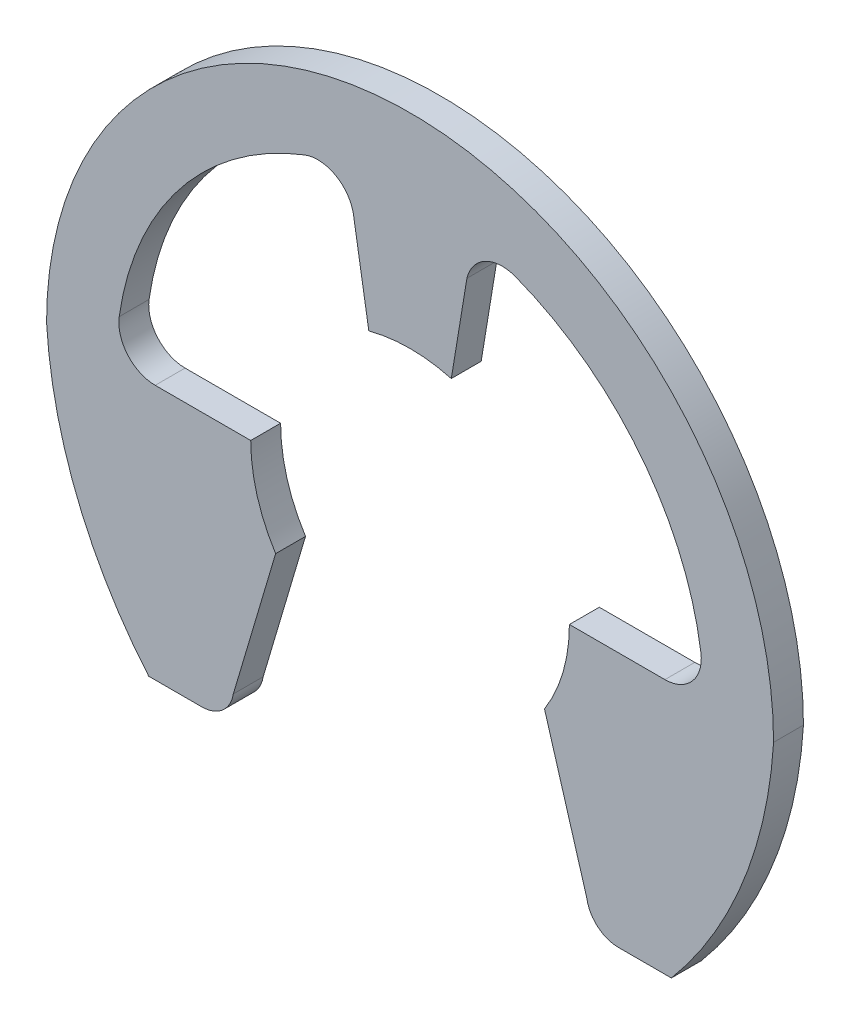
ISO-10303-21;
HEADER;
FILE_DESCRIPTION(('STEP AP214'),'2;1');
FILE_NAME('part.step','',(''),(''),'','','');
FILE_SCHEMA(('AUTOMOTIVE_DESIGN { 1 0 10303 214 1 1 1 1 }'));
ENDSEC;
DATA;
#1=APPLICATION_CONTEXT('core data for automotive mechanical design processes');
#2=APPLICATION_PROTOCOL_DEFINITION('international standard','automotive_design',2000,#1);
#3=PRODUCT_CONTEXT('',#1,'mechanical');
#4=PRODUCT('Part','Part','',(#3));
#5=PRODUCT_RELATED_PRODUCT_CATEGORY('part','',(#4));
#6=PRODUCT_DEFINITION_FORMATION('','',#4);
#7=PRODUCT_DEFINITION_CONTEXT('part definition',#1,'design');
#8=PRODUCT_DEFINITION('design','',#6,#7);
#9=PRODUCT_DEFINITION_SHAPE('','',#8);
#10=(LENGTH_UNIT() NAMED_UNIT(*) SI_UNIT(.MILLI.,.METRE.));
#11=(NAMED_UNIT(*) PLANE_ANGLE_UNIT() SI_UNIT($,.RADIAN.));
#12=(NAMED_UNIT(*) SI_UNIT($,.STERADIAN.) SOLID_ANGLE_UNIT());
#13=UNCERTAINTY_MEASURE_WITH_UNIT(LENGTH_MEASURE(1.E-05),#10,'distance_accuracy_value','');
#14=(GEOMETRIC_REPRESENTATION_CONTEXT(3) GLOBAL_UNCERTAINTY_ASSIGNED_CONTEXT((#13)) GLOBAL_UNIT_ASSIGNED_CONTEXT((#10,
#11,#12)) REPRESENTATION_CONTEXT('',''));
#15=CARTESIAN_POINT('',(0.,0.,0.));
#16=DIRECTION('',(0.,0.,1.));
#17=DIRECTION('',(1.,0.,0.));
#18=AXIS2_PLACEMENT_3D('',#15,#16,#17);
#19=CARTESIAN_POINT('',(-4.18201394390324,-4.48466089832876,0.3));
#20=DIRECTION('',(0.,0.,1.));
#21=DIRECTION('',(1.,0.,0.));
#22=AXIS2_PLACEMENT_3D('',#19,#20,#21);
#23=PLANE('',#22);
#24=CARTESIAN_POINT('',(0.,0.,0.3));
#25=DIRECTION('',(0.,0.,1.));
#26=DIRECTION('',(1.,0.,0.));
#27=AXIS2_PLACEMENT_3D('',#24,#25,#26);
#28=CIRCLE('',#27,3.2);
#29=CARTESIAN_POINT('',(-2.69962159550398,-1.71815111124969,0.3));
#30=VERTEX_POINT('',#29);
#31=CARTESIAN_POINT('',(-3.2,0.,0.3));
#32=VERTEX_POINT('',#31);
#33=EDGE_CURVE('E192',#30,#32,#28,.F.);
#34=ORIENTED_EDGE('',*,*,#33,.T.);
#35=DIRECTION('',(-1.,0.,0.));
#36=VECTOR('',#35,1.);
#37=CARTESIAN_POINT('',(-3.2,0.,0.3));
#38=LINE('',#37,#36);
#39=CARTESIAN_POINT('',(-5.11820280958072,0.,0.3));
#40=VERTEX_POINT('',#39);
#41=EDGE_CURVE('E463',#32,#40,#38,.T.);
#42=ORIENTED_EDGE('',*,*,#41,.T.);
#43=CARTESIAN_POINT('',(-5.11820280958072,0.73,0.3));
#44=DIRECTION('',(0.,0.,-1.));
#45=DIRECTION('',(-1.,0.,0.));
#46=AXIS2_PLACEMENT_3D('',#43,#44,#45);
#47=CIRCLE('',#46,0.73);
#48=CARTESIAN_POINT('',(-5.84088908636872,0.833075435203094,0.3));
#49=VERTEX_POINT('',#48);
#50=EDGE_CURVE('E476',#40,#49,#47,.T.);
#51=ORIENTED_EDGE('',*,*,#50,.T.);
#52=CARTESIAN_POINT('',(0.,0.,0.3));
#53=DIRECTION('',(0.,0.,-1.));
#54=DIRECTION('',(-1.,0.,0.));
#55=AXIS2_PLACEMENT_3D('',#52,#53,#54);
#56=CIRCLE('',#55,5.9);
#57=CARTESIAN_POINT('',(-2.11437090231727,5.50812451633349,0.3));
#58=VERTEX_POINT('',#57);
#59=EDGE_CURVE('E479',#49,#58,#56,.T.);
#60=ORIENTED_EDGE('',*,*,#59,.T.);
#61=CARTESIAN_POINT('',(-1.8527622991492,4.82661080499053,0.3));
#62=DIRECTION('',(0.,0.,-1.));
#63=DIRECTION('',(-1.,0.,0.));
#64=AXIS2_PLACEMENT_3D('',#61,#62,#63);
#65=CIRCLE('',#64,0.73);
#66=CARTESIAN_POINT('',(-1.14147215185598,4.99082507466156,0.3));
#67=VERTEX_POINT('',#66);
#68=EDGE_CURVE('E185',#58,#67,#65,.T.);
#69=ORIENTED_EDGE('',*,*,#68,.T.);
#70=DIRECTION('',(-0.162684474099473,0.986678145033616,0.));
#71=VECTOR('',#70,1.);
#72=CARTESIAN_POINT('',(-0.828220944328066,3.09096264412502,0.3));
#73=LINE('',#72,#71);
#74=CARTESIAN_POINT('',(-0.828220944328067,3.09096264412502,0.3));
#75=VERTEX_POINT('',#74);
#76=EDGE_CURVE('E168',#75,#67,#73,.T.);
#77=ORIENTED_EDGE('',*,*,#76,.F.);
#78=CARTESIAN_POINT('',(0.828220944328067,3.09096264412502,0.3));
#79=VERTEX_POINT('',#78);
#80=EDGE_CURVE('E181',#75,#79,#28,.F.);
#81=ORIENTED_EDGE('',*,*,#80,.T.);
#82=DIRECTION('',(-0.162684474099473,-0.986678145033616,0.));
#83=VECTOR('',#82,1.);
#84=CARTESIAN_POINT('',(-0.520399119135775,-5.0883915932068,0.3));
#85=LINE('',#84,#83);
#86=CARTESIAN_POINT('',(1.14147215185598,4.99082507466156,0.3));
#87=VERTEX_POINT('',#86);
#88=EDGE_CURVE('E215',#87,#79,#85,.T.);
#89=ORIENTED_EDGE('',*,*,#88,.F.);
#90=CARTESIAN_POINT('',(1.8527622991492,4.82661080499053,0.3));
#91=DIRECTION('',(0.,0.,1.));
#92=DIRECTION('',(1.,0.,0.));
#93=AXIS2_PLACEMENT_3D('',#90,#91,#92);
#94=CIRCLE('',#93,0.73);
#95=CARTESIAN_POINT('',(2.11437090231727,5.50812451633349,0.3));
#96=VERTEX_POINT('',#95);
#97=EDGE_CURVE('E226',#87,#96,#94,.F.);
#98=ORIENTED_EDGE('',*,*,#97,.T.);
#99=CARTESIAN_POINT('',(0.,0.,0.3));
#100=DIRECTION('',(0.,0.,1.));
#101=DIRECTION('',(1.,0.,0.));
#102=AXIS2_PLACEMENT_3D('',#99,#100,#101);
#103=CIRCLE('',#102,5.9);
#104=CARTESIAN_POINT('',(5.84088908636872,0.833075435203094,0.3));
#105=VERTEX_POINT('',#104);
#106=EDGE_CURVE('E230',#96,#105,#103,.F.);
#107=ORIENTED_EDGE('',*,*,#106,.T.);
#108=CARTESIAN_POINT('',(5.11820280958072,0.73,0.3));
#109=DIRECTION('',(0.,0.,1.));
#110=DIRECTION('',(1.,0.,0.));
#111=AXIS2_PLACEMENT_3D('',#108,#109,#110);
#112=CIRCLE('',#111,0.73);
#113=CARTESIAN_POINT('',(5.11820280958072,0.,0.3));
#114=VERTEX_POINT('',#113);
#115=EDGE_CURVE('E234',#105,#114,#112,.F.);
#116=ORIENTED_EDGE('',*,*,#115,.T.);
#117=DIRECTION('',(-1.,0.,0.));
#118=VECTOR('',#117,1.);
#119=CARTESIAN_POINT('',(-4.18201394390324,0.,0.3));
#120=LINE('',#119,#118);
#121=CARTESIAN_POINT('',(3.2,0.,0.3));
#122=VERTEX_POINT('',#121);
#123=EDGE_CURVE('E238',#114,#122,#120,.T.);
#124=ORIENTED_EDGE('',*,*,#123,.T.);
#125=CARTESIAN_POINT('',(2.69962159550398,-1.71815111124969,0.3));
#126=VERTEX_POINT('',#125);
#127=EDGE_CURVE('E195',#122,#126,#28,.F.);
#128=ORIENTED_EDGE('',*,*,#127,.T.);
#129=DIRECTION('',(0.284365205501345,-0.95871603194073,0.));
#130=VECTOR('',#129,1.);
#131=CARTESIAN_POINT('',(2.19,0.,0.3));
#132=LINE('',#131,#130);
#133=CARTESIAN_POINT('',(3.54989340592235,-4.5847789559545,0.3));
#134=VERTEX_POINT('',#133);
#135=EDGE_CURVE('E288',#126,#134,#132,.T.);
#136=ORIENTED_EDGE('',*,*,#135,.T.);
#137=CARTESIAN_POINT('',(4.18201394390324,-4.48466089832876,0.3));
#138=DIRECTION('',(0.,0.,1.));
#139=DIRECTION('',(1.,0.,0.));
#140=AXIS2_PLACEMENT_3D('',#137,#138,#139);
#141=CIRCLE('',#140,0.64);
#142=CARTESIAN_POINT('',(4.18201394390324,-5.12466089832876,0.3));
#143=VERTEX_POINT('',#142);
#144=EDGE_CURVE('E285',#134,#143,#141,.T.);
#145=ORIENTED_EDGE('',*,*,#144,.T.);
#146=DIRECTION('',(1.,0.,0.));
#147=VECTOR('',#146,1.);
#148=CARTESIAN_POINT('',(4.18201394390324,-5.12466089832876,0.3));
#149=LINE('',#148,#147);
#150=CARTESIAN_POINT('',(5.24781394390324,-5.12466089832876,0.3));
#151=VERTEX_POINT('',#150);
#152=EDGE_CURVE('E282',#143,#151,#149,.T.);
#153=ORIENTED_EDGE('',*,*,#152,.T.);
#154=CARTESIAN_POINT('',(-1.44405206702632,0.528349741300863,0.3));
#155=DIRECTION('',(0.,0.,1.));
#156=DIRECTION('',(1.,0.,0.));
#157=AXIS2_PLACEMENT_3D('',#154,#155,#156);
#158=CIRCLE('',#157,8.76);
#159=CARTESIAN_POINT('',(7.3,0.,0.3));
#160=VERTEX_POINT('',#159);
#161=EDGE_CURVE('E279',#151,#160,#158,.T.);
#162=ORIENTED_EDGE('',*,*,#161,.T.);
#163=CARTESIAN_POINT('',(0.,0.,0.3));
#164=DIRECTION('',(0.,0.,1.));
#165=DIRECTION('',(1.,0.,0.));
#166=AXIS2_PLACEMENT_3D('',#163,#164,#165);
#167=CIRCLE('',#166,7.3);
#168=CARTESIAN_POINT('',(-7.3,0.,0.3));
#169=VERTEX_POINT('',#168);
#170=EDGE_CURVE('E276',#160,#169,#167,.T.);
#171=ORIENTED_EDGE('',*,*,#170,.T.);
#172=CARTESIAN_POINT('',(1.44405206702632,0.528349741300862,0.3));
#173=DIRECTION('',(0.,0.,1.));
#174=DIRECTION('',(1.,0.,0.));
#175=AXIS2_PLACEMENT_3D('',#172,#173,#174);
#176=CIRCLE('',#175,8.76);
#177=CARTESIAN_POINT('',(-5.24781394390324,-5.12466089832875,0.3));
#178=VERTEX_POINT('',#177);
#179=EDGE_CURVE('E273',#169,#178,#176,.T.);
#180=ORIENTED_EDGE('',*,*,#179,.T.);
#181=DIRECTION('',(1.,0.,0.));
#182=VECTOR('',#181,1.);
#183=CARTESIAN_POINT('',(-5.24781394390324,-5.12466089832875,0.3));
#184=LINE('',#183,#182);
#185=CARTESIAN_POINT('',(-4.18201394390324,-5.12466089832875,0.3));
#186=VERTEX_POINT('',#185);
#187=EDGE_CURVE('E269',#178,#186,#184,.T.);
#188=ORIENTED_EDGE('',*,*,#187,.T.);
#189=CARTESIAN_POINT('',(-4.18201394390324,-4.48466089832876,0.3));
#190=DIRECTION('',(0.,0.,1.));
#191=DIRECTION('',(1.,0.,0.));
#192=AXIS2_PLACEMENT_3D('',#189,#190,#191);
#193=CIRCLE('',#192,0.64);
#194=CARTESIAN_POINT('',(-3.54989340592235,-4.5847789559545,0.3));
#195=VERTEX_POINT('',#194);
#196=EDGE_CURVE('E244',#186,#195,#193,.T.);
#197=ORIENTED_EDGE('',*,*,#196,.T.);
#198=DIRECTION('',(0.284365205501345,0.95871603194073,0.));
#199=VECTOR('',#198,1.);
#200=CARTESIAN_POINT('',(-3.54989340592235,-4.5847789559545,0.3));
#201=LINE('',#200,#199);
#202=EDGE_CURVE('E290',#195,#30,#201,.T.);
#203=ORIENTED_EDGE('',*,*,#202,.T.);
#204=EDGE_LOOP('',(#34,#42,#51,#60,#69,#77,#81,#89,#98,#107,#116,#124,#128,#136,#145,#153,#162,
#171,#180,#188,#197,#203));
#205=FACE_BOUND('',#204,.T.);
#206=ADVANCED_FACE('F16',(#205),#23,.T.);
#207=CARTESIAN_POINT('',(-4.18201394390324,-4.48466089832876,-0.3));
#208=DIRECTION('',(0.,0.,1.));
#209=DIRECTION('',(1.,0.,0.));
#210=AXIS2_PLACEMENT_3D('',#207,#208,#209);
#211=PLANE('',#210);
#212=DIRECTION('',(-1.,0.,0.));
#213=VECTOR('',#212,1.);
#214=CARTESIAN_POINT('',(-4.18201394390324,0.,-0.3));
#215=LINE('',#214,#213);
#216=CARTESIAN_POINT('',(-3.2,0.,-0.3));
#217=VERTEX_POINT('',#216);
#218=CARTESIAN_POINT('',(-5.11820280958072,0.,-0.3));
#219=VERTEX_POINT('',#218);
#220=EDGE_CURVE('E353',#217,#219,#215,.T.);
#221=ORIENTED_EDGE('',*,*,#220,.F.);
#222=CARTESIAN_POINT('',(0.,0.,-0.3));
#223=DIRECTION('',(0.,0.,1.));
#224=DIRECTION('',(1.,0.,0.));
#225=AXIS2_PLACEMENT_3D('',#222,#223,#224);
#226=CIRCLE('',#225,3.2);
#227=CARTESIAN_POINT('',(-2.69962159550398,-1.71815111124969,-0.3));
#228=VERTEX_POINT('',#227);
#229=EDGE_CURVE('E40',#217,#228,#226,.T.);
#230=ORIENTED_EDGE('',*,*,#229,.T.);
#231=DIRECTION('',(0.284365205501345,0.95871603194073,0.));
#232=VECTOR('',#231,1.);
#233=CARTESIAN_POINT('',(-3.54989340592235,-4.5847789559545,-0.3));
#234=LINE('',#233,#232);
#235=CARTESIAN_POINT('',(-3.54989340592235,-4.5847789559545,-0.3));
#236=VERTEX_POINT('',#235);
#237=EDGE_CURVE('E263',#236,#228,#234,.T.);
#238=ORIENTED_EDGE('',*,*,#237,.F.);
#239=CARTESIAN_POINT('',(-4.18201394390324,-4.48466089832876,-0.3));
#240=DIRECTION('',(0.,0.,1.));
#241=DIRECTION('',(1.,0.,0.));
#242=AXIS2_PLACEMENT_3D('',#239,#240,#241);
#243=CIRCLE('',#242,0.64);
#244=CARTESIAN_POINT('',(-4.18201394390324,-5.12466089832875,-0.3));
#245=VERTEX_POINT('',#244);
#246=EDGE_CURVE('E240',#245,#236,#243,.T.);
#247=ORIENTED_EDGE('',*,*,#246,.F.);
#248=DIRECTION('',(1.,0.,0.));
#249=VECTOR('',#248,1.);
#250=CARTESIAN_POINT('',(-5.24781394390324,-5.12466089832875,-0.3));
#251=LINE('',#250,#249);
#252=CARTESIAN_POINT('',(-5.24781394390324,-5.12466089832875,-0.3));
#253=VERTEX_POINT('',#252);
#254=EDGE_CURVE('E241',#253,#245,#251,.T.);
#255=ORIENTED_EDGE('',*,*,#254,.F.);
#256=CARTESIAN_POINT('',(1.44405206702632,0.528349741300862,-0.3));
#257=DIRECTION('',(0.,0.,1.));
#258=DIRECTION('',(1.,0.,0.));
#259=AXIS2_PLACEMENT_3D('',#256,#257,#258);
#260=CIRCLE('',#259,8.76);
#261=CARTESIAN_POINT('',(-7.3,0.,-0.3));
#262=VERTEX_POINT('',#261);
#263=EDGE_CURVE('E245',#262,#253,#260,.T.);
#264=ORIENTED_EDGE('',*,*,#263,.F.);
#265=CARTESIAN_POINT('',(0.,0.,-0.3));
#266=DIRECTION('',(0.,0.,1.));
#267=DIRECTION('',(1.,0.,0.));
#268=AXIS2_PLACEMENT_3D('',#265,#266,#267);
#269=CIRCLE('',#268,7.3);
#270=CARTESIAN_POINT('',(7.3,0.,-0.3));
#271=VERTEX_POINT('',#270);
#272=EDGE_CURVE('E248',#271,#262,#269,.T.);
#273=ORIENTED_EDGE('',*,*,#272,.F.);
#274=CARTESIAN_POINT('',(-1.44405206702632,0.528349741300863,-0.3));
#275=DIRECTION('',(0.,0.,1.));
#276=DIRECTION('',(1.,0.,0.));
#277=AXIS2_PLACEMENT_3D('',#274,#275,#276);
#278=CIRCLE('',#277,8.76);
#279=CARTESIAN_POINT('',(5.24781394390324,-5.12466089832876,-0.3));
#280=VERTEX_POINT('',#279);
#281=EDGE_CURVE('E251',#280,#271,#278,.T.);
#282=ORIENTED_EDGE('',*,*,#281,.F.);
#283=DIRECTION('',(1.,0.,0.));
#284=VECTOR('',#283,1.);
#285=CARTESIAN_POINT('',(4.18201394390324,-5.12466089832876,-0.3));
#286=LINE('',#285,#284);
#287=CARTESIAN_POINT('',(4.18201394390324,-5.12466089832876,-0.3));
#288=VERTEX_POINT('',#287);
#289=EDGE_CURVE('E254',#288,#280,#286,.T.);
#290=ORIENTED_EDGE('',*,*,#289,.F.);
#291=CARTESIAN_POINT('',(4.18201394390324,-4.48466089832876,-0.3));
#292=DIRECTION('',(0.,0.,1.));
#293=DIRECTION('',(1.,0.,0.));
#294=AXIS2_PLACEMENT_3D('',#291,#292,#293);
#295=CIRCLE('',#294,0.64);
#296=CARTESIAN_POINT('',(3.54989340592235,-4.5847789559545,-0.3));
#297=VERTEX_POINT('',#296);
#298=EDGE_CURVE('E257',#297,#288,#295,.T.);
#299=ORIENTED_EDGE('',*,*,#298,.F.);
#300=DIRECTION('',(0.284365205501345,-0.95871603194073,0.));
#301=VECTOR('',#300,1.);
#302=CARTESIAN_POINT('',(2.19,0.,-0.3));
#303=LINE('',#302,#301);
#304=CARTESIAN_POINT('',(2.69962159550398,-1.71815111124969,-0.3));
#305=VERTEX_POINT('',#304);
#306=EDGE_CURVE('E260',#305,#297,#303,.T.);
#307=ORIENTED_EDGE('',*,*,#306,.F.);
#308=CARTESIAN_POINT('',(0.,0.,-0.3));
#309=DIRECTION('',(0.,0.,1.));
#310=DIRECTION('',(1.,0.,0.));
#311=AXIS2_PLACEMENT_3D('',#308,#309,#310);
#312=CIRCLE('',#311,3.2);
#313=CARTESIAN_POINT('',(3.2,0.,-0.3));
#314=VERTEX_POINT('',#313);
#315=EDGE_CURVE('E301',#314,#305,#312,.F.);
#316=ORIENTED_EDGE('',*,*,#315,.F.);
#317=DIRECTION('',(1.,0.,0.));
#318=VECTOR('',#317,1.);
#319=CARTESIAN_POINT('',(3.2,0.,-0.3));
#320=LINE('',#319,#318);
#321=CARTESIAN_POINT('',(5.11820280958072,0.,-0.3));
#322=VERTEX_POINT('',#321);
#323=EDGE_CURVE('E359',#314,#322,#320,.T.);
#324=ORIENTED_EDGE('',*,*,#323,.T.);
#325=CARTESIAN_POINT('',(5.11820280958072,0.73,-0.3));
#326=DIRECTION('',(0.,0.,1.));
#327=DIRECTION('',(1.,0.,0.));
#328=AXIS2_PLACEMENT_3D('',#325,#326,#327);
#329=CIRCLE('',#328,0.73);
#330=CARTESIAN_POINT('',(5.84088908636872,0.833075435203094,-0.3));
#331=VERTEX_POINT('',#330);
#332=EDGE_CURVE('E379',#322,#331,#329,.T.);
#333=ORIENTED_EDGE('',*,*,#332,.T.);
#334=CARTESIAN_POINT('',(0.,0.,-0.3));
#335=DIRECTION('',(0.,0.,1.));
#336=DIRECTION('',(1.,0.,0.));
#337=AXIS2_PLACEMENT_3D('',#334,#335,#336);
#338=CIRCLE('',#337,5.9);
#339=CARTESIAN_POINT('',(2.11437090231727,5.50812451633349,-0.3));
#340=VERTEX_POINT('',#339);
#341=EDGE_CURVE('E375',#331,#340,#338,.T.);
#342=ORIENTED_EDGE('',*,*,#341,.T.);
#343=CARTESIAN_POINT('',(1.8527622991492,4.82661080499053,-0.3));
#344=DIRECTION('',(0.,0.,1.));
#345=DIRECTION('',(1.,0.,0.));
#346=AXIS2_PLACEMENT_3D('',#343,#344,#345);
#347=CIRCLE('',#346,0.73);
#348=CARTESIAN_POINT('',(1.14147215185598,4.99082507466156,-0.3));
#349=VERTEX_POINT('',#348);
#350=EDGE_CURVE('E371',#340,#349,#347,.T.);
#351=ORIENTED_EDGE('',*,*,#350,.T.);
#352=DIRECTION('',(0.162684474099473,0.986678145033616,0.));
#353=VECTOR('',#352,1.);
#354=CARTESIAN_POINT('',(0.828220944328066,3.09096264412502,-0.3));
#355=LINE('',#354,#353);
#356=CARTESIAN_POINT('',(0.828220944328067,3.09096264412502,-0.3));
#357=VERTEX_POINT('',#356);
#358=EDGE_CURVE('E367',#357,#349,#355,.T.);
#359=ORIENTED_EDGE('',*,*,#358,.F.);
#360=CARTESIAN_POINT('',(-0.828220944328067,3.09096264412502,-0.3));
#361=VERTEX_POINT('',#360);
#362=EDGE_CURVE('E351',#357,#361,#226,.T.);
#363=ORIENTED_EDGE('',*,*,#362,.T.);
#364=DIRECTION('',(-0.162684474099473,0.986678145033616,0.));
#365=VECTOR('',#364,1.);
#366=CARTESIAN_POINT('',(0.299034765473132,-3.74582112938446,-0.3));
#367=LINE('',#366,#365);
#368=CARTESIAN_POINT('',(-1.14147215185598,4.99082507466156,-0.3));
#369=VERTEX_POINT('',#368);
#370=EDGE_CURVE('E32',#361,#369,#367,.T.);
#371=ORIENTED_EDGE('',*,*,#370,.T.);
#372=CARTESIAN_POINT('',(-1.8527622991492,4.82661080499053,-0.3));
#373=DIRECTION('',(0.,0.,1.));
#374=DIRECTION('',(1.,0.,0.));
#375=AXIS2_PLACEMENT_3D('',#372,#373,#374);
#376=CIRCLE('',#375,0.73);
#377=CARTESIAN_POINT('',(-2.11437090231727,5.50812451633349,-0.3));
#378=VERTEX_POINT('',#377);
#379=EDGE_CURVE('E331',#378,#369,#376,.F.);
#380=ORIENTED_EDGE('',*,*,#379,.F.);
#381=CARTESIAN_POINT('',(0.,0.,-0.3));
#382=DIRECTION('',(0.,0.,1.));
#383=DIRECTION('',(1.,0.,0.));
#384=AXIS2_PLACEMENT_3D('',#381,#382,#383);
#385=CIRCLE('',#384,5.9);
#386=CARTESIAN_POINT('',(-5.84088908636872,0.833075435203094,-0.3));
#387=VERTEX_POINT('',#386);
#388=EDGE_CURVE('E25',#387,#378,#385,.F.);
#389=ORIENTED_EDGE('',*,*,#388,.F.);
#390=CARTESIAN_POINT('',(-5.11820280958072,0.73,-0.3));
#391=DIRECTION('',(0.,0.,1.));
#392=DIRECTION('',(1.,0.,0.));
#393=AXIS2_PLACEMENT_3D('',#390,#391,#392);
#394=CIRCLE('',#393,0.73);
#395=EDGE_CURVE('E11',#219,#387,#394,.F.);
#396=ORIENTED_EDGE('',*,*,#395,.F.);
#397=EDGE_LOOP('',(#221,#230,#238,#247,#255,#264,#273,#282,#290,#299,#307,#316,#324,#333,#342,
#351,#359,#363,#371,#380,#389,#396));
#398=FACE_BOUND('',#397,.T.);
#399=ADVANCED_FACE('F349',(#398),#211,.F.);
#400=CARTESIAN_POINT('',(0.,0.,1.3));
#401=DIRECTION('',(0.,0.,-1.));
#402=DIRECTION('',(-1.,0.,0.));
#403=AXIS2_PLACEMENT_3D('',#400,#401,#402);
#404=CYLINDRICAL_SURFACE('',#403,3.2);
#405=ORIENTED_EDGE('',*,*,#229,.F.);
#406=DIRECTION('',(0.,0.,1.));
#407=VECTOR('',#406,1.);
#408=CARTESIAN_POINT('',(-3.2,0.,-1.3));
#409=LINE('',#408,#407);
#410=EDGE_CURVE('E176',#217,#32,#409,.T.);
#411=ORIENTED_EDGE('',*,*,#410,.T.);
#412=ORIENTED_EDGE('',*,*,#33,.F.);
#413=DIRECTION('',(0.,0.,-1.));
#414=VECTOR('',#413,1.);
#415=CARTESIAN_POINT('',(-2.69962159550398,-1.71815111124969,1.3));
#416=LINE('',#415,#414);
#417=EDGE_CURVE('E200',#30,#228,#416,.T.);
#418=ORIENTED_EDGE('',*,*,#417,.T.);
#419=EDGE_LOOP('',(#405,#411,#412,#418));
#420=FACE_BOUND('',#419,.T.);
#421=ADVANCED_FACE('F465',(#420),#404,.F.);
#422=CARTESIAN_POINT('',(-3.54989340592235,-4.5847789559545,0.3));
#423=DIRECTION('',(-0.95871603194073,0.284365205501345,0.));
#424=DIRECTION('',(-0.284365205501345,-0.95871603194073,0.));
#425=AXIS2_PLACEMENT_3D('',#422,#423,#424);
#426=PLANE('',#425);
#427=ORIENTED_EDGE('',*,*,#417,.F.);
#428=ORIENTED_EDGE('',*,*,#202,.F.);
#429=DIRECTION('',(0.,0.,-1.));
#430=VECTOR('',#429,1.);
#431=CARTESIAN_POINT('',(-3.54989340592235,-4.5847789559545,0.3));
#432=LINE('',#431,#430);
#433=EDGE_CURVE('E297',#195,#236,#432,.T.);
#434=ORIENTED_EDGE('',*,*,#433,.T.);
#435=ORIENTED_EDGE('',*,*,#237,.T.);
#436=EDGE_LOOP('',(#427,#428,#434,#435));
#437=FACE_BOUND('',#436,.T.);
#438=ADVANCED_FACE('F460',(#437),#426,.F.);
#439=CARTESIAN_POINT('',(2.19,0.,0.3));
#440=DIRECTION('',(0.95871603194073,0.284365205501345,0.));
#441=DIRECTION('',(-0.284365205501345,0.95871603194073,0.));
#442=AXIS2_PLACEMENT_3D('',#439,#440,#441);
#443=PLANE('',#442);
#444=DIRECTION('',(0.,0.,-1.));
#445=VECTOR('',#444,1.);
#446=CARTESIAN_POINT('',(2.69962159550398,-1.71815111124969,1.3));
#447=LINE('',#446,#445);
#448=EDGE_CURVE('E208',#305,#126,#447,.F.);
#449=ORIENTED_EDGE('',*,*,#448,.F.);
#450=ORIENTED_EDGE('',*,*,#306,.T.);
#451=DIRECTION('',(0.,0.,-1.));
#452=VECTOR('',#451,1.);
#453=CARTESIAN_POINT('',(3.54989340592235,-4.5847789559545,0.3));
#454=LINE('',#453,#452);
#455=EDGE_CURVE('E302',#134,#297,#454,.T.);
#456=ORIENTED_EDGE('',*,*,#455,.F.);
#457=ORIENTED_EDGE('',*,*,#135,.F.);
#458=EDGE_LOOP('',(#449,#450,#456,#457));
#459=FACE_BOUND('',#458,.T.);
#460=ADVANCED_FACE('F423',(#459),#443,.F.);
#461=CARTESIAN_POINT('',(-4.18201394390324,-4.48466089832876,0.3));
#462=DIRECTION('',(0.,0.,-1.));
#463=DIRECTION('',(-1.,0.,0.));
#464=AXIS2_PLACEMENT_3D('',#461,#462,#463);
#465=CYLINDRICAL_SURFACE('',#464,0.64);
#466=ORIENTED_EDGE('',*,*,#246,.T.);
#467=ORIENTED_EDGE('',*,*,#433,.F.);
#468=ORIENTED_EDGE('',*,*,#196,.F.);
#469=DIRECTION('',(0.,0.,-1.));
#470=VECTOR('',#469,1.);
#471=CARTESIAN_POINT('',(-4.18201394390324,-5.12466089832875,0.3));
#472=LINE('',#471,#470);
#473=EDGE_CURVE('E272',#186,#245,#472,.T.);
#474=ORIENTED_EDGE('',*,*,#473,.T.);
#475=EDGE_LOOP('',(#466,#467,#468,#474));
#476=FACE_BOUND('',#475,.T.);
#477=ADVANCED_FACE('F18',(#476),#465,.T.);
#478=CARTESIAN_POINT('',(4.18201394390324,-4.48466089832876,0.3));
#479=DIRECTION('',(0.,0.,-1.));
#480=DIRECTION('',(-1.,0.,0.));
#481=AXIS2_PLACEMENT_3D('',#478,#479,#480);
#482=CYLINDRICAL_SURFACE('',#481,0.64);
#483=ORIENTED_EDGE('',*,*,#298,.T.);
#484=DIRECTION('',(0.,0.,-1.));
#485=VECTOR('',#484,1.);
#486=CARTESIAN_POINT('',(4.18201394390324,-5.12466089832876,0.3));
#487=LINE('',#486,#485);
#488=EDGE_CURVE('E306',#143,#288,#487,.T.);
#489=ORIENTED_EDGE('',*,*,#488,.F.);
#490=ORIENTED_EDGE('',*,*,#144,.F.);
#491=ORIENTED_EDGE('',*,*,#455,.T.);
#492=EDGE_LOOP('',(#483,#489,#490,#491));
#493=FACE_BOUND('',#492,.T.);
#494=ADVANCED_FACE('F430',(#493),#482,.T.);
#495=CARTESIAN_POINT('',(4.18201394390324,-5.12466089832876,0.3));
#496=DIRECTION('',(0.,1.,0.));
#497=DIRECTION('',(0.,0.,1.));
#498=AXIS2_PLACEMENT_3D('',#495,#496,#497);
#499=PLANE('',#498);
#500=ORIENTED_EDGE('',*,*,#289,.T.);
#501=DIRECTION('',(0.,0.,-1.));
#502=VECTOR('',#501,1.);
#503=CARTESIAN_POINT('',(5.24781394390324,-5.12466089832876,0.3));
#504=LINE('',#503,#502);
#505=EDGE_CURVE('E310',#151,#280,#504,.T.);
#506=ORIENTED_EDGE('',*,*,#505,.F.);
#507=ORIENTED_EDGE('',*,*,#152,.F.);
#508=ORIENTED_EDGE('',*,*,#488,.T.);
#509=EDGE_LOOP('',(#500,#506,#507,#508));
#510=FACE_BOUND('',#509,.T.);
#511=ADVANCED_FACE('F434',(#510),#499,.F.);
#512=CARTESIAN_POINT('',(-1.44405206702632,0.528349741300863,0.3));
#513=DIRECTION('',(0.,0.,-1.));
#514=DIRECTION('',(-1.,0.,0.));
#515=AXIS2_PLACEMENT_3D('',#512,#513,#514);
#516=CYLINDRICAL_SURFACE('',#515,8.76);
#517=ORIENTED_EDGE('',*,*,#281,.T.);
#518=DIRECTION('',(0.,0.,-1.));
#519=VECTOR('',#518,1.);
#520=CARTESIAN_POINT('',(7.3,0.,0.3));
#521=LINE('',#520,#519);
#522=EDGE_CURVE('E314',#160,#271,#521,.T.);
#523=ORIENTED_EDGE('',*,*,#522,.F.);
#524=ORIENTED_EDGE('',*,*,#161,.F.);
#525=ORIENTED_EDGE('',*,*,#505,.T.);
#526=EDGE_LOOP('',(#517,#523,#524,#525));
#527=FACE_BOUND('',#526,.T.);
#528=ADVANCED_FACE('F441',(#527),#516,.T.);
#529=CARTESIAN_POINT('',(0.,0.,0.3));
#530=DIRECTION('',(0.,0.,-1.));
#531=DIRECTION('',(-1.,0.,0.));
#532=AXIS2_PLACEMENT_3D('',#529,#530,#531);
#533=CYLINDRICAL_SURFACE('',#532,7.3);
#534=ORIENTED_EDGE('',*,*,#272,.T.);
#535=DIRECTION('',(0.,0.,-1.));
#536=VECTOR('',#535,1.);
#537=CARTESIAN_POINT('',(-7.3,0.,0.3));
#538=LINE('',#537,#536);
#539=EDGE_CURVE('E318',#169,#262,#538,.T.);
#540=ORIENTED_EDGE('',*,*,#539,.F.);
#541=ORIENTED_EDGE('',*,*,#170,.F.);
#542=ORIENTED_EDGE('',*,*,#522,.T.);
#543=EDGE_LOOP('',(#534,#540,#541,#542));
#544=FACE_BOUND('',#543,.T.);
#545=ADVANCED_FACE('F444',(#544),#533,.T.);
#546=CARTESIAN_POINT('',(1.44405206702632,0.528349741300862,0.3));
#547=DIRECTION('',(0.,0.,-1.));
#548=DIRECTION('',(-1.,0.,0.));
#549=AXIS2_PLACEMENT_3D('',#546,#547,#548);
#550=CYLINDRICAL_SURFACE('',#549,8.76);
#551=ORIENTED_EDGE('',*,*,#263,.T.);
#552=DIRECTION('',(0.,0.,-1.));
#553=VECTOR('',#552,1.);
#554=CARTESIAN_POINT('',(-5.24781394390324,-5.12466089832875,0.3));
#555=LINE('',#554,#553);
#556=EDGE_CURVE('E322',#178,#253,#555,.T.);
#557=ORIENTED_EDGE('',*,*,#556,.F.);
#558=ORIENTED_EDGE('',*,*,#179,.F.);
#559=ORIENTED_EDGE('',*,*,#539,.T.);
#560=EDGE_LOOP('',(#551,#557,#558,#559));
#561=FACE_BOUND('',#560,.T.);
#562=ADVANCED_FACE('F449',(#561),#550,.T.);
#563=CARTESIAN_POINT('',(-5.24781394390324,-5.12466089832875,0.3));
#564=DIRECTION('',(0.,1.,0.));
#565=DIRECTION('',(0.,0.,1.));
#566=AXIS2_PLACEMENT_3D('',#563,#564,#565);
#567=PLANE('',#566);
#568=ORIENTED_EDGE('',*,*,#254,.T.);
#569=ORIENTED_EDGE('',*,*,#473,.F.);
#570=ORIENTED_EDGE('',*,*,#187,.F.);
#571=ORIENTED_EDGE('',*,*,#556,.T.);
#572=EDGE_LOOP('',(#568,#569,#570,#571));
#573=FACE_BOUND('',#572,.T.);
#574=ADVANCED_FACE('F455',(#573),#567,.F.);
#575=ORIENTED_EDGE('',*,*,#448,.T.);
#576=ORIENTED_EDGE('',*,*,#127,.F.);
#577=DIRECTION('',(0.,0.,-1.));
#578=VECTOR('',#577,1.);
#579=CARTESIAN_POINT('',(3.2,0.,1.3));
#580=LINE('',#579,#578);
#581=EDGE_CURVE('E366',#122,#314,#580,.T.);
#582=ORIENTED_EDGE('',*,*,#581,.T.);
#583=ORIENTED_EDGE('',*,*,#315,.T.);
#584=EDGE_LOOP('',(#575,#576,#582,#583));
#585=FACE_BOUND('',#584,.T.);
#586=ADVANCED_FACE('F419',(#585),#404,.F.);
#587=DIRECTION('',(0.,0.,1.));
#588=VECTOR('',#587,1.);
#589=CARTESIAN_POINT('',(-0.828220944328066,3.09096264412502,-1.3));
#590=LINE('',#589,#588);
#591=EDGE_CURVE('E165',#361,#75,#590,.T.);
#592=ORIENTED_EDGE('',*,*,#591,.F.);
#593=ORIENTED_EDGE('',*,*,#362,.F.);
#594=DIRECTION('',(0.,0.,-1.));
#595=VECTOR('',#594,1.);
#596=CARTESIAN_POINT('',(0.828220944328067,3.09096264412502,1.3));
#597=LINE('',#596,#595);
#598=EDGE_CURVE('E190',#79,#357,#597,.T.);
#599=ORIENTED_EDGE('',*,*,#598,.F.);
#600=ORIENTED_EDGE('',*,*,#80,.F.);
#601=EDGE_LOOP('',(#592,#593,#599,#600));
#602=FACE_BOUND('',#601,.T.);
#603=ADVANCED_FACE('F189',(#602),#404,.F.);
#604=CARTESIAN_POINT('',(3.2,0.,1.3));
#605=DIRECTION('',(0.,1.,0.));
#606=DIRECTION('',(0.,0.,1.));
#607=AXIS2_PLACEMENT_3D('',#604,#605,#606);
#608=PLANE('',#607);
#609=DIRECTION('',(0.,0.,-1.));
#610=VECTOR('',#609,1.);
#611=CARTESIAN_POINT('',(5.11820280958072,0.,1.3));
#612=LINE('',#611,#610);
#613=EDGE_CURVE('E193',#114,#322,#612,.T.);
#614=ORIENTED_EDGE('',*,*,#613,.T.);
#615=ORIENTED_EDGE('',*,*,#323,.F.);
#616=ORIENTED_EDGE('',*,*,#581,.F.);
#617=ORIENTED_EDGE('',*,*,#123,.F.);
#618=EDGE_LOOP('',(#614,#615,#616,#617));
#619=FACE_BOUND('',#618,.T.);
#620=ADVANCED_FACE('F415',(#619),#608,.T.);
#621=CARTESIAN_POINT('',(5.11820280958072,0.73,1.3));
#622=DIRECTION('',(0.,0.,-1.));
#623=DIRECTION('',(-1.,0.,0.));
#624=AXIS2_PLACEMENT_3D('',#621,#622,#623);
#625=CYLINDRICAL_SURFACE('',#624,0.73);
#626=DIRECTION('',(0.,0.,-1.));
#627=VECTOR('',#626,1.);
#628=CARTESIAN_POINT('',(5.84088908636872,0.833075435203094,1.3));
#629=LINE('',#628,#627);
#630=EDGE_CURVE('E202',#105,#331,#629,.T.);
#631=ORIENTED_EDGE('',*,*,#630,.T.);
#632=ORIENTED_EDGE('',*,*,#332,.F.);
#633=ORIENTED_EDGE('',*,*,#613,.F.);
#634=ORIENTED_EDGE('',*,*,#115,.F.);
#635=EDGE_LOOP('',(#631,#632,#633,#634));
#636=FACE_BOUND('',#635,.T.);
#637=ADVANCED_FACE('F411',(#636),#625,.F.);
#638=CARTESIAN_POINT('',(0.,0.,1.3));
#639=DIRECTION('',(0.,0.,-1.));
#640=DIRECTION('',(-1.,0.,0.));
#641=AXIS2_PLACEMENT_3D('',#638,#639,#640);
#642=CYLINDRICAL_SURFACE('',#641,5.9);
#643=DIRECTION('',(0.,0.,-1.));
#644=VECTOR('',#643,1.);
#645=CARTESIAN_POINT('',(2.11437090231727,5.50812451633349,1.3));
#646=LINE('',#645,#644);
#647=EDGE_CURVE('E388',#96,#340,#646,.T.);
#648=ORIENTED_EDGE('',*,*,#647,.T.);
#649=ORIENTED_EDGE('',*,*,#341,.F.);
#650=ORIENTED_EDGE('',*,*,#630,.F.);
#651=ORIENTED_EDGE('',*,*,#106,.F.);
#652=EDGE_LOOP('',(#648,#649,#650,#651));
#653=FACE_BOUND('',#652,.T.);
#654=ADVANCED_FACE('F408',(#653),#642,.F.);
#655=CARTESIAN_POINT('',(1.8527622991492,4.82661080499053,1.3));
#656=DIRECTION('',(0.,0.,-1.));
#657=DIRECTION('',(-1.,0.,0.));
#658=AXIS2_PLACEMENT_3D('',#655,#656,#657);
#659=CYLINDRICAL_SURFACE('',#658,0.73);
#660=DIRECTION('',(0.,0.,-1.));
#661=VECTOR('',#660,1.);
#662=CARTESIAN_POINT('',(1.14147215185598,4.99082507466156,1.3));
#663=LINE('',#662,#661);
#664=EDGE_CURVE('E391',#87,#349,#663,.T.);
#665=ORIENTED_EDGE('',*,*,#664,.T.);
#666=ORIENTED_EDGE('',*,*,#350,.F.);
#667=ORIENTED_EDGE('',*,*,#647,.F.);
#668=ORIENTED_EDGE('',*,*,#97,.F.);
#669=EDGE_LOOP('',(#665,#666,#667,#668));
#670=FACE_BOUND('',#669,.T.);
#671=ADVANCED_FACE('F405',(#670),#659,.F.);
#672=CARTESIAN_POINT('',(0.828220944328066,3.09096264412502,1.3));
#673=DIRECTION('',(-0.986678145033616,0.162684474099473,0.));
#674=DIRECTION('',(-0.162684474099473,-0.986678145033616,0.));
#675=AXIS2_PLACEMENT_3D('',#672,#673,#674);
#676=PLANE('',#675);
#677=ORIENTED_EDGE('',*,*,#88,.T.);
#678=ORIENTED_EDGE('',*,*,#598,.T.);
#679=ORIENTED_EDGE('',*,*,#358,.T.);
#680=ORIENTED_EDGE('',*,*,#664,.F.);
#681=EDGE_LOOP('',(#677,#678,#679,#680));
#682=FACE_BOUND('',#681,.T.);
#683=ADVANCED_FACE('F399',(#682),#676,.F.);
#684=CARTESIAN_POINT('',(-5.11820280958072,0.73,-1.3));
#685=DIRECTION('',(0.,0.,1.));
#686=DIRECTION('',(1.,0.,0.));
#687=AXIS2_PLACEMENT_3D('',#684,#685,#686);
#688=CYLINDRICAL_SURFACE('',#687,0.73);
#689=ORIENTED_EDGE('',*,*,#395,.T.);
#690=DIRECTION('',(0.,0.,1.));
#691=VECTOR('',#690,1.);
#692=CARTESIAN_POINT('',(-5.84088908636872,0.833075435203094,-1.3));
#693=LINE('',#692,#691);
#694=EDGE_CURVE('E342',#387,#49,#693,.T.);
#695=ORIENTED_EDGE('',*,*,#694,.T.);
#696=ORIENTED_EDGE('',*,*,#50,.F.);
#697=DIRECTION('',(0.,0.,1.));
#698=VECTOR('',#697,1.);
#699=CARTESIAN_POINT('',(-5.11820280958072,0.,-1.3));
#700=LINE('',#699,#698);
#701=EDGE_CURVE('E354',#219,#40,#700,.T.);
#702=ORIENTED_EDGE('',*,*,#701,.F.);
#703=EDGE_LOOP('',(#689,#695,#696,#702));
#704=FACE_BOUND('',#703,.T.);
#705=ADVANCED_FACE('F657',(#704),#688,.F.);
#706=CARTESIAN_POINT('',(0.,0.,-1.3));
#707=DIRECTION('',(0.,0.,1.));
#708=DIRECTION('',(1.,0.,0.));
#709=AXIS2_PLACEMENT_3D('',#706,#707,#708);
#710=CYLINDRICAL_SURFACE('',#709,5.9);
#711=ORIENTED_EDGE('',*,*,#388,.T.);
#712=DIRECTION('',(0.,0.,1.));
#713=VECTOR('',#712,1.);
#714=CARTESIAN_POINT('',(-2.11437090231727,5.50812451633349,-1.3));
#715=LINE('',#714,#713);
#716=EDGE_CURVE('E341',#378,#58,#715,.T.);
#717=ORIENTED_EDGE('',*,*,#716,.T.);
#718=ORIENTED_EDGE('',*,*,#59,.F.);
#719=ORIENTED_EDGE('',*,*,#694,.F.);
#720=EDGE_LOOP('',(#711,#717,#718,#719));
#721=FACE_BOUND('',#720,.T.);
#722=ADVANCED_FACE('F339',(#721),#710,.F.);
#723=CARTESIAN_POINT('',(-1.8527622991492,4.82661080499053,-1.3));
#724=DIRECTION('',(0.,0.,1.));
#725=DIRECTION('',(1.,0.,0.));
#726=AXIS2_PLACEMENT_3D('',#723,#724,#725);
#727=CYLINDRICAL_SURFACE('',#726,0.73);
#728=ORIENTED_EDGE('',*,*,#379,.T.);
#729=DIRECTION('',(0.,0.,1.));
#730=VECTOR('',#729,1.);
#731=CARTESIAN_POINT('',(-1.14147215185598,4.99082507466156,-1.3));
#732=LINE('',#731,#730);
#733=EDGE_CURVE('E175',#369,#67,#732,.T.);
#734=ORIENTED_EDGE('',*,*,#733,.T.);
#735=ORIENTED_EDGE('',*,*,#68,.F.);
#736=ORIENTED_EDGE('',*,*,#716,.F.);
#737=EDGE_LOOP('',(#728,#734,#735,#736));
#738=FACE_BOUND('',#737,.T.);
#739=ADVANCED_FACE('F346',(#738),#727,.F.);
#740=CARTESIAN_POINT('',(-3.2,0.,-1.3));
#741=DIRECTION('',(0.,1.,0.));
#742=DIRECTION('',(0.,0.,-1.));
#743=AXIS2_PLACEMENT_3D('',#740,#741,#742);
#744=PLANE('',#743);
#745=ORIENTED_EDGE('',*,*,#220,.T.);
#746=ORIENTED_EDGE('',*,*,#701,.T.);
#747=ORIENTED_EDGE('',*,*,#41,.F.);
#748=ORIENTED_EDGE('',*,*,#410,.F.);
#749=EDGE_LOOP('',(#745,#746,#747,#748));
#750=FACE_BOUND('',#749,.T.);
#751=ADVANCED_FACE('F686',(#750),#744,.T.);
#752=CARTESIAN_POINT('',(-0.828220944328066,3.09096264412502,-1.3));
#753=DIRECTION('',(0.986678145033616,0.162684474099473,0.));
#754=DIRECTION('',(0.162684474099473,-0.986678145033616,0.));
#755=AXIS2_PLACEMENT_3D('',#752,#753,#754);
#756=PLANE('',#755);
#757=ORIENTED_EDGE('',*,*,#591,.T.);
#758=ORIENTED_EDGE('',*,*,#76,.T.);
#759=ORIENTED_EDGE('',*,*,#733,.F.);
#760=ORIENTED_EDGE('',*,*,#370,.F.);
#761=EDGE_LOOP('',(#757,#758,#759,#760));
#762=FACE_BOUND('',#761,.T.);
#763=ADVANCED_FACE('F167',(#762),#756,.F.);
#764=CLOSED_SHELL('',(#206,#399,#421,#438,#460,#477,#494,#511,#528,#545,#562,#574,#586,#603,
#620,#637,#654,#671,#683,#705,#722,#739,#751,#763));
#765=MANIFOLD_SOLID_BREP('B1',#764);
#766=ADVANCED_BREP_SHAPE_REPRESENTATION('',(#18,#765),#14);
#767=SHAPE_DEFINITION_REPRESENTATION(#9,#766);
ENDSEC;
END-ISO-10303-21;
